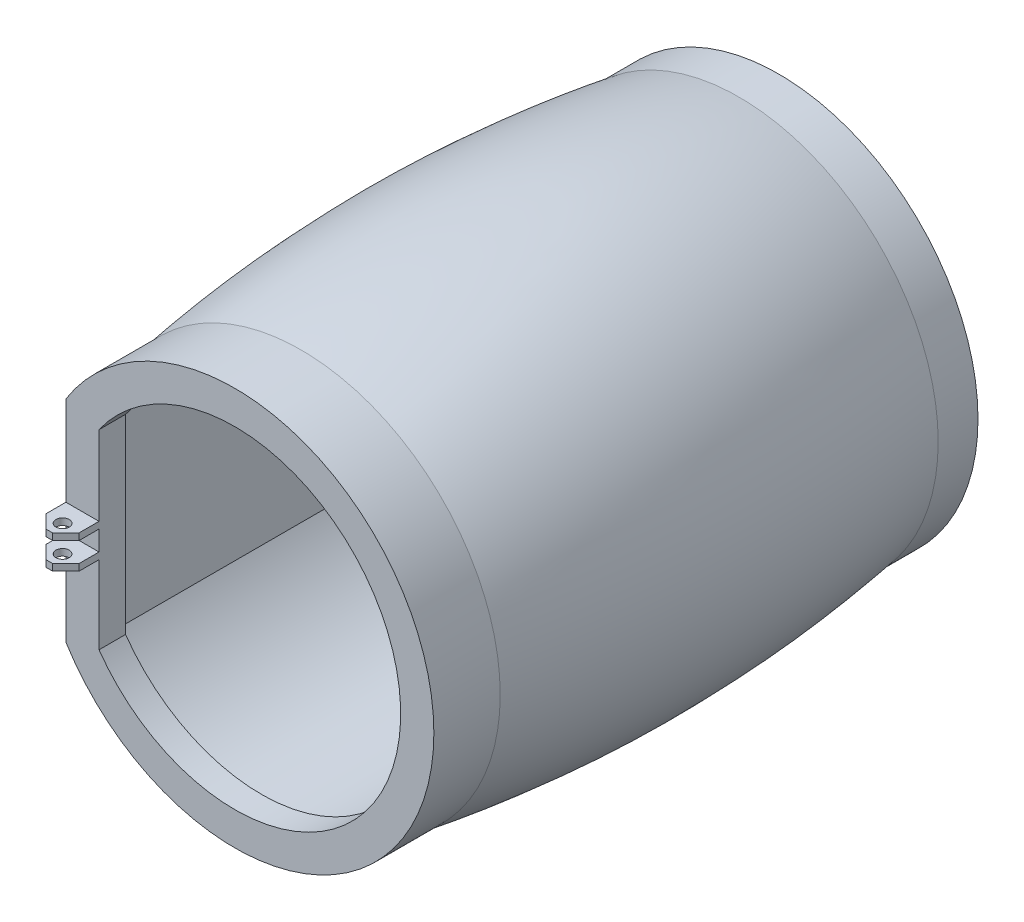
ISO-10303-21;
HEADER;
FILE_DESCRIPTION(('STEP AP214'),'2;1');
FILE_NAME('part.step','',(''),(''),'','','');
FILE_SCHEMA(('AUTOMOTIVE_DESIGN { 1 0 10303 214 1 1 1 1 }'));
ENDSEC;
DATA;
#1=APPLICATION_CONTEXT('core data for automotive mechanical design processes');
#2=APPLICATION_PROTOCOL_DEFINITION('international standard','automotive_design',2000,#1);
#3=PRODUCT_CONTEXT('',#1,'mechanical');
#4=PRODUCT('Part','Part','',(#3));
#5=PRODUCT_RELATED_PRODUCT_CATEGORY('part','',(#4));
#6=PRODUCT_DEFINITION_FORMATION('','',#4);
#7=PRODUCT_DEFINITION_CONTEXT('part definition',#1,'design');
#8=PRODUCT_DEFINITION('design','',#6,#7);
#9=PRODUCT_DEFINITION_SHAPE('','',#8);
#10=(LENGTH_UNIT() NAMED_UNIT(*) SI_UNIT(.MILLI.,.METRE.));
#11=(NAMED_UNIT(*) PLANE_ANGLE_UNIT() SI_UNIT($,.RADIAN.));
#12=(NAMED_UNIT(*) SI_UNIT($,.STERADIAN.) SOLID_ANGLE_UNIT());
#13=UNCERTAINTY_MEASURE_WITH_UNIT(LENGTH_MEASURE(1.E-05),#10,'distance_accuracy_value','');
#14=(GEOMETRIC_REPRESENTATION_CONTEXT(3) GLOBAL_UNCERTAINTY_ASSIGNED_CONTEXT((#13)) GLOBAL_UNIT_ASSIGNED_CONTEXT((#10,
#11,#12)) REPRESENTATION_CONTEXT('',''));
#15=CARTESIAN_POINT('',(0.,0.,0.));
#16=DIRECTION('',(0.,0.,1.));
#17=DIRECTION('',(1.,0.,0.));
#18=AXIS2_PLACEMENT_3D('',#15,#16,#17);
#19=CARTESIAN_POINT('',(-12.7256757763495,1.19854065609115,40.5));
#20=DIRECTION('',(1.,0.,0.));
#21=DIRECTION('',(0.,0.,-1.));
#22=AXIS2_PLACEMENT_3D('',#19,#20,#21);
#23=PLANE('',#22);
#24=DIRECTION('',(0.,0.,-1.));
#25=VECTOR('',#24,1.);
#26=CARTESIAN_POINT('',(-12.7256757763495,-1.30145934390885,40.5));
#27=LINE('',#26,#25);
#28=CARTESIAN_POINT('',(-12.7256757763495,-1.30145934390885,39.5));
#29=VERTEX_POINT('',#28);
#30=CARTESIAN_POINT('',(-12.7281293563886,-1.30145934390884,38.));
#31=VERTEX_POINT('',#30);
#32=EDGE_CURVE('E230',#29,#31,#27,.T.);
#33=ORIENTED_EDGE('',*,*,#32,.F.);
#34=DIRECTION('',(0.,1.,0.));
#35=VECTOR('',#34,1.);
#36=CARTESIAN_POINT('',(-12.7256757763495,-0.801459343908846,39.5));
#37=LINE('',#36,#35);
#38=CARTESIAN_POINT('',(-12.7256757763495,-0.801459343908846,39.5));
#39=VERTEX_POINT('',#38);
#40=EDGE_CURVE('E352',#29,#39,#37,.T.);
#41=ORIENTED_EDGE('',*,*,#40,.T.);
#42=DIRECTION('',(0.,0.,1.));
#43=VECTOR('',#42,1.);
#44=CARTESIAN_POINT('',(-12.7256757763495,-0.801459343908846,38.));
#45=LINE('',#44,#43);
#46=CARTESIAN_POINT('',(-12.7281293563886,-0.801459343908846,38.));
#47=VERTEX_POINT('',#46);
#48=EDGE_CURVE('E211',#47,#39,#45,.T.);
#49=ORIENTED_EDGE('',*,*,#48,.F.);
#50=CARTESIAN_POINT('',(-12.7256757763495,-0.801459343908846,38.));
#51=DIRECTION('',(0.,-1.,0.));
#52=VECTOR('',#51,1.);
#53=LINE('',#50,#52);
#54=EDGE_CURVE('E354',#47,#31,#53,.T.);
#55=ORIENTED_EDGE('',*,*,#54,.T.);
#56=EDGE_LOOP('',(#33,#41,#49,#55));
#57=FACE_BOUND('',#56,.T.);
#58=ADVANCED_FACE('F43',(#57),#23,.F.);
#59=CARTESIAN_POINT('',(0.,0.,40.5));
#60=DIRECTION('',(0.,0.,1.));
#61=DIRECTION('',(1.,0.,0.));
#62=AXIS2_PLACEMENT_3D('',#59,#60,#61);
#63=PLANE('',#62);
#64=DIRECTION('',(1.,0.,0.));
#65=VECTOR('',#64,1.);
#66=CARTESIAN_POINT('',(-12.7256757763495,-0.801459343908846,40.5));
#67=LINE('',#66,#65);
#68=CARTESIAN_POINT('',(-11.7256757763495,-0.801459343908846,40.5));
#69=VERTEX_POINT('',#68);
#70=CARTESIAN_POINT('',(-11.23,-0.801459343908846,40.5));
#71=VERTEX_POINT('',#70);
#72=EDGE_CURVE('E203',#69,#71,#67,.T.);
#73=ORIENTED_EDGE('',*,*,#72,.F.);
#74=DIRECTION('',(0.,-1.,0.));
#75=VECTOR('',#74,1.);
#76=CARTESIAN_POINT('',(-11.7256757763495,-1.30145934390885,40.5));
#77=LINE('',#76,#75);
#78=CARTESIAN_POINT('',(-11.7256757763495,-1.30145934390885,40.5));
#79=VERTEX_POINT('',#78);
#80=EDGE_CURVE('E401',#69,#79,#77,.T.);
#81=ORIENTED_EDGE('',*,*,#80,.T.);
#82=DIRECTION('',(1.,0.,0.));
#83=VECTOR('',#82,1.);
#84=CARTESIAN_POINT('',(-12.7256757763495,-1.30145934390885,40.5));
#85=LINE('',#84,#83);
#86=CARTESIAN_POINT('',(-11.23,-1.30145934390885,40.5));
#87=VERTEX_POINT('',#86);
#88=EDGE_CURVE('E222',#79,#87,#85,.T.);
#89=ORIENTED_EDGE('',*,*,#88,.T.);
#90=DIRECTION('',(0.,1.,0.));
#91=VECTOR('',#90,1.);
#92=CARTESIAN_POINT('',(-11.23,-0.801459343908846,40.5));
#93=LINE('',#92,#91);
#94=EDGE_CURVE('E407',#87,#71,#93,.T.);
#95=ORIENTED_EDGE('',*,*,#94,.T.);
#96=EDGE_LOOP('',(#73,#81,#89,#95));
#97=FACE_BOUND('',#96,.T.);
#98=ADVANCED_FACE('F324',(#97),#63,.T.);
#99=CARTESIAN_POINT('',(-12.7305829364277,-7.93298544677444,33.));
#100=DIRECTION('',(1.,0.,0.));
#101=DIRECTION('',(0.,0.,-1.));
#102=AXIS2_PLACEMENT_3D('',#99,#100,#101);
#103=PLANE('',#102);
#104=DIRECTION('',(0.,0.,-1.));
#105=VECTOR('',#104,1.);
#106=CARTESIAN_POINT('',(-12.7305829364278,-7.93298544677419,36.));
#107=LINE('',#106,#105);
#108=CARTESIAN_POINT('',(-12.7305829364278,-7.93298544677419,38.));
#109=VERTEX_POINT('',#108);
#110=CARTESIAN_POINT('',(-12.7305829364277,-7.93298544677425,33.));
#111=VERTEX_POINT('',#110);
#112=EDGE_CURVE('E533',#109,#111,#107,.T.);
#113=ORIENTED_EDGE('',*,*,#112,.F.);
#114=CARTESIAN_POINT('',(-12.7305829364277,-1.30145934390884,38.));
#115=DIRECTION('',(0.,-1.,0.));
#116=VECTOR('',#115,1.);
#117=LINE('',#114,#116);
#118=EDGE_CURVE('E297',#31,#109,#117,.T.);
#119=ORIENTED_EDGE('',*,*,#118,.F.);
#120=ORIENTED_EDGE('',*,*,#54,.F.);
#121=DIRECTION('',(0.,-1.,0.));
#122=VECTOR('',#121,1.);
#123=CARTESIAN_POINT('',(-12.7305829364277,-7.93298544677444,38.));
#124=LINE('',#123,#122);
#125=CARTESIAN_POINT('',(-12.7281293563886,0.698540656091155,38.));
#126=VERTEX_POINT('',#125);
#127=EDGE_CURVE('E192',#126,#47,#124,.T.);
#128=ORIENTED_EDGE('',*,*,#127,.F.);
#129=CARTESIAN_POINT('',(-12.7256757763495,1.19854065609115,38.));
#130=DIRECTION('',(0.,-1.,0.));
#131=VECTOR('',#130,1.);
#132=LINE('',#129,#131);
#133=CARTESIAN_POINT('',(-12.7281293563886,1.19854065609115,38.));
#134=VERTEX_POINT('',#133);
#135=EDGE_CURVE('E239',#134,#126,#132,.T.);
#136=ORIENTED_EDGE('',*,*,#135,.F.);
#137=CARTESIAN_POINT('',(-12.7305829364277,7.93298544677428,38.));
#138=DIRECTION('',(0.,-1.,0.));
#139=VECTOR('',#138,1.);
#140=LINE('',#137,#139);
#141=CARTESIAN_POINT('',(-12.7305829364277,7.93298544677428,38.));
#142=VERTEX_POINT('',#141);
#143=EDGE_CURVE('E492',#142,#134,#140,.T.);
#144=ORIENTED_EDGE('',*,*,#143,.F.);
#145=DIRECTION('',(0.,0.,-1.));
#146=VECTOR('',#145,1.);
#147=CARTESIAN_POINT('',(-12.7305829364277,7.93298544677428,36.));
#148=LINE('',#147,#146);
#149=CARTESIAN_POINT('',(-12.7305829364277,7.93298544677425,33.));
#150=VERTEX_POINT('',#149);
#151=EDGE_CURVE('E309',#150,#142,#148,.F.);
#152=ORIENTED_EDGE('',*,*,#151,.F.);
#153=CARTESIAN_POINT('',(-12.7305829364277,7.93298544677409,33.0000000000001));
#154=CARTESIAN_POINT('',(-12.7305829364277,8.00837206629518,32.7475623512414));
#155=CARTESIAN_POINT('',(-12.7305829364277,8.08146704888806,32.4944489521295));
#156=CARTESIAN_POINT('',(-12.7305829364277,8.22325568738766,31.9870000357536));
#157=CARTESIAN_POINT('',(-12.7305829364277,8.29194947688966,31.7326645558371));
#158=CARTESIAN_POINT('',(-12.7305829364277,8.49164607614323,30.9682353714513));
#159=CARTESIAN_POINT('',(-12.7305829364277,8.61633456610338,30.4564816236054));
#160=CARTESIAN_POINT('',(-12.7305829364277,8.84996032241162,29.4294701807765));
#161=CARTESIAN_POINT('',(-12.7305829364277,8.95889921338174,28.9142128529483));
#162=CARTESIAN_POINT('',(-12.7305829364277,9.16181168313684,27.88113196776));
#163=CARTESIAN_POINT('',(-12.7305829364277,9.25579547947788,27.3633104138897));
#164=CARTESIAN_POINT('',(-12.7305829364277,9.42953491665978,26.3252307143703));
#165=CARTESIAN_POINT('',(-12.7305829364277,9.50928890448771,25.8049722928358));
#166=CARTESIAN_POINT('',(-12.7305829364277,9.65504479871085,24.7625098329909));
#167=CARTESIAN_POINT('',(-12.7305829364277,9.72104601135835,24.2403056978823));
#168=CARTESIAN_POINT('',(-12.7305829364277,9.83954820880807,23.1953529165281));
#169=CARTESIAN_POINT('',(-12.7305829364277,9.89207402675923,22.6726070805153));
#170=CARTESIAN_POINT('',(-12.7305829364277,9.9840524889991,21.6260022655936));
#171=CARTESIAN_POINT('',(-12.7305829364277,10.0235059669603,21.1021433598146));
#172=CARTESIAN_POINT('',(-12.7305829364277,10.0895340608829,20.0536452982112));
#173=CARTESIAN_POINT('',(-12.7305829364277,10.1161093949715,19.5290061875303));
#174=CARTESIAN_POINT('',(-12.7305829364277,10.15651650427,18.4790228224062));
#175=CARTESIAN_POINT('',(-12.7305829364277,10.1703430462815,17.9536783669627));
#176=CARTESIAN_POINT('',(-12.7305829364277,10.1852970680309,16.902781178733));
#177=CARTESIAN_POINT('',(-12.7305829364277,10.1864238857039,16.3772284365167));
#178=CARTESIAN_POINT('',(-12.7305829364277,10.175980761889,15.326163174232));
#179=CARTESIAN_POINT('',(-12.7305829364277,10.1644087059074,14.8006506754377));
#180=CARTESIAN_POINT('',(-12.7305829364277,10.1258618334699,13.6724680435438));
#181=CARTESIAN_POINT('',(-12.7305829364277,10.0968644940287,13.0698658247955));
#182=CARTESIAN_POINT('',(-12.7305829364277,10.021893388911,11.8656613076854));
#183=CARTESIAN_POINT('',(-12.7305829364277,9.97591802965207,11.2640591085131));
#184=CARTESIAN_POINT('',(-12.7305829364277,9.86669908643272,10.0624553205015));
#185=CARTESIAN_POINT('',(-12.7305829364277,9.80345650781428,9.46245364052904));
#186=CARTESIAN_POINT('',(-12.7305829364277,9.6592784078111,8.26466488162684));
#187=CARTESIAN_POINT('',(-12.7305829364277,9.57834555448058,7.66687748254961));
#188=CARTESIAN_POINT('',(-12.7305829364277,9.39811419547927,6.47367267227986));
#189=CARTESIAN_POINT('',(-12.7305829364277,9.29880368630545,5.87825707140157));
#190=CARTESIAN_POINT('',(-12.7305829364277,9.08101428124022,4.69090718869277));
#191=CARTESIAN_POINT('',(-12.7305829364277,8.96253516421566,4.09897294710562));
#192=CARTESIAN_POINT('',(-12.7305829364277,8.76956609762279,3.2143318729075));
#193=CARTESIAN_POINT('',(-12.7305829364277,8.70268971016925,2.9199491860141));
#194=CARTESIAN_POINT('',(-12.7305829364277,8.5636675930795,2.33243036775551));
#195=CARTESIAN_POINT('',(-12.7305829364277,8.49152192887362,2.03929422095944));
#196=CARTESIAN_POINT('',(-12.7305829364277,8.34169284948403,1.45419259046193));
#197=CARTESIAN_POINT('',(-12.7305829364277,8.26400511538917,1.16222821125265));
#198=CARTESIAN_POINT('',(-12.7305829364277,8.10287586479882,0.579879006120832));
#199=CARTESIAN_POINT('',(-12.7305829364277,8.0194341008544,0.289494248709161));
#200=CARTESIAN_POINT('',(-12.7305829364277,7.93298544677448,0.));
#201=B_SPLINE_CURVE_WITH_KNOTS('',3,(#153,#154,#155,#156,#157,#158,#159,#160,#161,#162,#163,
#164,#165,#166,#167,#168,#169,#170,#171,#172,#173,#174,#175,#176,#177,#178,#179,#180,#181,#182,
#183,#184,#185,#186,#187,#188,#189,#190,#191,#192,#193,#194,#195,#196,#197,#198,#199,#200),
.UNSPECIFIED.,.F.,.F.,(4,2,2,2,2,2,2,2,2,2,2,2,2,2,2,2,2,2,2,2,2,2,2,4),(0.,0.790336265037755,
1.58064852856817,3.16053083364895,4.74025005230529,6.31888530442319,7.89770382027957,
9.47660195909956,11.052569176648,12.6284358694648,14.2042146767263,15.7806400312548,
17.3571475679462,18.9339176492674,20.7435744376166,22.5534011262796,24.3631224646404,
26.1725710482138,27.9832056850179,29.7938612111789,30.6994718223357,31.6050711901399,
32.5113841638653,33.4177361374223),.UNSPECIFIED.);
#202=CARTESIAN_POINT('',(-12.7305829364277,7.93298544677448,0.));
#203=VERTEX_POINT('',#202);
#204=EDGE_CURVE('E415',#150,#203,#201,.T.);
#205=ORIENTED_EDGE('',*,*,#204,.T.);
#206=DIRECTION('',(0.,0.,1.));
#207=VECTOR('',#206,1.);
#208=CARTESIAN_POINT('',(-12.7305829364277,7.93298544677449,-3.));
#209=LINE('',#208,#207);
#210=CARTESIAN_POINT('',(-12.7305829364277,7.93298544677449,-3.));
#211=VERTEX_POINT('',#210);
#212=EDGE_CURVE('E525',#211,#203,#209,.T.);
#213=ORIENTED_EDGE('',*,*,#212,.F.);
#214=DIRECTION('',(0.,-1.,0.));
#215=VECTOR('',#214,1.);
#216=CARTESIAN_POINT('',(-12.7305829364277,10.1844229008457,-3.));
#217=LINE('',#216,#215);
#218=CARTESIAN_POINT('',(-12.7305829364278,-7.93298544677439,-3.));
#219=VERTEX_POINT('',#218);
#220=EDGE_CURVE('E522',#211,#219,#217,.T.);
#221=ORIENTED_EDGE('',*,*,#220,.T.);
#222=DIRECTION('',(0.,0.,1.));
#223=VECTOR('',#222,1.);
#224=CARTESIAN_POINT('',(-12.7305829364278,-7.93298544677439,-3.));
#225=LINE('',#224,#223);
#226=CARTESIAN_POINT('',(-12.7305829364278,-7.93298544677439,0.));
#227=VERTEX_POINT('',#226);
#228=EDGE_CURVE('E529',#227,#219,#225,.F.);
#229=ORIENTED_EDGE('',*,*,#228,.F.);
#230=CARTESIAN_POINT('',(-12.7305829364278,-7.9329854467744,0.));
#231=CARTESIAN_POINT('',(-12.7305829364278,-8.00837206629549,0.252437648758758));
#232=CARTESIAN_POINT('',(-12.7305829364278,-8.08146704888837,0.505551047870649));
#233=CARTESIAN_POINT('',(-12.7305829364278,-8.22325568738795,1.01299996424665));
#234=CARTESIAN_POINT('',(-12.7305829364278,-8.29194947688993,1.26733544416315));
#235=CARTESIAN_POINT('',(-12.7305829364278,-8.4916460761435,2.03176462854896));
#236=CARTESIAN_POINT('',(-12.7305829364278,-8.61633456610368,2.54351837639488));
#237=CARTESIAN_POINT('',(-12.7305829364278,-8.84996032241191,3.57052981922388));
#238=CARTESIAN_POINT('',(-12.7305829364278,-8.95889921338199,4.08578714705205));
#239=CARTESIAN_POINT('',(-12.7305829364278,-9.16181168313706,5.11886803224043));
#240=CARTESIAN_POINT('',(-12.7305829364278,-9.25579547947813,5.63668958611073));
#241=CARTESIAN_POINT('',(-12.7305829364278,-9.42953491665998,6.67476928563026));
#242=CARTESIAN_POINT('',(-12.7305829364278,-9.50928890448784,7.19502770716477));
#243=CARTESIAN_POINT('',(-12.7305829364278,-9.65504479871094,8.23749016700975));
#244=CARTESIAN_POINT('',(-12.7305829364278,-9.72104601135848,8.75969430211834));
#245=CARTESIAN_POINT('',(-12.7305829364278,-9.83954820880819,9.80464708347265));
#246=CARTESIAN_POINT('',(-12.7305829364278,-9.89207402675932,10.3273929194855));
#247=CARTESIAN_POINT('',(-12.7305829364278,-9.98405248899915,11.3739977344072));
#248=CARTESIAN_POINT('',(-12.7305829364278,-10.0235059669603,11.8978566401862));
#249=CARTESIAN_POINT('',(-12.7305829364278,-10.0895340608829,12.9463547017897));
#250=CARTESIAN_POINT('',(-12.7305829364278,-10.1161093949715,13.4709938124706));
#251=CARTESIAN_POINT('',(-12.7305829364278,-10.15651650427,14.5209771775947));
#252=CARTESIAN_POINT('',(-12.7305829364278,-10.1703430462815,15.0463216330383));
#253=CARTESIAN_POINT('',(-12.7305829364278,-10.1852970680308,16.0972188212681));
#254=CARTESIAN_POINT('',(-12.7305829364278,-10.1864238857038,16.6227715634844));
#255=CARTESIAN_POINT('',(-12.7305829364278,-10.1759807618889,17.6738368257691));
#256=CARTESIAN_POINT('',(-12.7305829364278,-10.1644087059073,18.1993493245635));
#257=CARTESIAN_POINT('',(-12.7305829364278,-10.1258618334697,19.3275319564573));
#258=CARTESIAN_POINT('',(-12.7305829364278,-10.0968644940285,19.9301341752055));
#259=CARTESIAN_POINT('',(-12.7305829364278,-10.0218933889108,21.1343386923156));
#260=CARTESIAN_POINT('',(-12.7305829364278,-9.97591802965182,21.7359408914879));
#261=CARTESIAN_POINT('',(-12.7305829364278,-9.86669908643245,22.9375446794994));
#262=CARTESIAN_POINT('',(-12.7305829364278,-9.80345650781401,23.5375463594718));
#263=CARTESIAN_POINT('',(-12.7305829364278,-9.65927840781077,24.7353351183739));
#264=CARTESIAN_POINT('',(-12.7305829364278,-9.5783455544802,25.3331225174511));
#265=CARTESIAN_POINT('',(-12.7305829364278,-9.39811419547883,26.5263273277208));
#266=CARTESIAN_POINT('',(-12.7305829364278,-9.29880368630501,27.121742928599));
#267=CARTESIAN_POINT('',(-12.7305829364278,-9.08101428123978,28.3090928113077));
#268=CARTESIAN_POINT('',(-12.7305829364278,-8.96253516421522,28.9010270528949));
#269=CARTESIAN_POINT('',(-12.7305829364278,-8.7695660976223,29.7856681270929));
#270=CARTESIAN_POINT('',(-12.7305829364278,-8.70268971016873,30.0800508139863));
#271=CARTESIAN_POINT('',(-12.7305829364278,-8.56366759307897,30.6675696322448));
#272=CARTESIAN_POINT('',(-12.7305829364278,-8.49152192887312,30.9607057790409));
#273=CARTESIAN_POINT('',(-12.7305829364278,-8.34169284948354,31.5458074095384));
#274=CARTESIAN_POINT('',(-12.7305829364278,-8.26400511538866,31.8377717887476));
#275=CARTESIAN_POINT('',(-12.7305829364278,-8.10287586479829,32.4201209938794));
#276=CARTESIAN_POINT('',(-12.7305829364278,-8.01943410085388,32.710505751291));
#277=CARTESIAN_POINT('',(-12.7305829364277,-7.932985446774,33.0000000000001));
#278=B_SPLINE_CURVE_WITH_KNOTS('',3,(#230,#231,#232,#233,#234,#235,#236,#237,#238,#239,#240,
#241,#242,#243,#244,#245,#246,#247,#248,#249,#250,#251,#252,#253,#254,#255,#256,#257,#258,#259,
#260,#261,#262,#263,#264,#265,#266,#267,#268,#269,#270,#271,#272,#273,#274,#275,#276,#277),
.UNSPECIFIED.,.F.,.F.,(4,2,2,2,2,2,2,2,2,2,2,2,2,2,2,2,2,2,2,2,2,2,2,4),(0.,0.790336265037792,
1.58064852856824,3.1605308336491,4.74025005230552,6.31888530442351,7.89770382027996,
9.47660195910003,11.0525691766486,12.6284358694654,14.204214676727,15.7806400312556,
17.3571475679471,18.9339176492683,20.7435744376174,22.5534011262803,24.363122464641,
26.1725710482143,27.9832056850183,29.7938612111792,30.6994718223359,31.60507119014,
32.5113841638654,33.4177361374223),.UNSPECIFIED.);
#279=EDGE_CURVE('E411',#227,#111,#278,.T.);
#280=ORIENTED_EDGE('',*,*,#279,.T.);
#281=EDGE_LOOP('',(#113,#119,#120,#128,#136,#144,#152,#205,#213,#221,#229,#280));
#282=FACE_BOUND('',#281,.T.);
#283=ADVANCED_FACE('F313',(#282),#103,.F.);
#284=CARTESIAN_POINT('',(0.,0.,0.));
#285=DIRECTION('',(0.,0.,1.));
#286=DIRECTION('',(1.,0.,0.));
#287=AXIS2_PLACEMENT_3D('',#284,#285,#286);
#288=CYLINDRICAL_SURFACE('',#287,13.5);
#289=CARTESIAN_POINT('',(0.,0.,36.));
#290=DIRECTION('',(0.,0.,1.));
#291=DIRECTION('',(1.,0.,0.));
#292=AXIS2_PLACEMENT_3D('',#289,#290,#291);
#293=CIRCLE('',#292,13.5);
#294=CARTESIAN_POINT('',(-11.23,-7.49246955282435,36.));
#295=VERTEX_POINT('',#294);
#296=CARTESIAN_POINT('',(-11.23,7.49246955282435,36.));
#297=VERTEX_POINT('',#296);
#298=EDGE_CURVE('E542',#295,#297,#293,.T.);
#299=ORIENTED_EDGE('',*,*,#298,.T.);
#300=DIRECTION('',(0.,0.,1.));
#301=VECTOR('',#300,1.);
#302=CARTESIAN_POINT('',(-11.23,7.49246955282435,0.));
#303=LINE('',#302,#301);
#304=CARTESIAN_POINT('',(-11.23,7.49246955282435,-3.));
#305=VERTEX_POINT('',#304);
#306=EDGE_CURVE('E545',#305,#297,#303,.T.);
#307=ORIENTED_EDGE('',*,*,#306,.F.);
#308=CARTESIAN_POINT('',(0.,0.,-3.));
#309=DIRECTION('',(0.,0.,-1.));
#310=DIRECTION('',(-1.,0.,0.));
#311=AXIS2_PLACEMENT_3D('',#308,#309,#310);
#312=CIRCLE('',#311,13.5);
#313=CARTESIAN_POINT('',(-11.23,-7.49246955282435,-3.));
#314=VERTEX_POINT('',#313);
#315=EDGE_CURVE('E534',#305,#314,#312,.T.);
#316=ORIENTED_EDGE('',*,*,#315,.T.);
#317=DIRECTION('',(0.,0.,1.));
#318=VECTOR('',#317,1.);
#319=CARTESIAN_POINT('',(-11.23,-7.49246955282435,0.));
#320=LINE('',#319,#318);
#321=EDGE_CURVE('E550',#314,#295,#320,.T.);
#322=ORIENTED_EDGE('',*,*,#321,.T.);
#323=EDGE_LOOP('',(#299,#307,#316,#322));
#324=FACE_BOUND('',#323,.T.);
#325=ADVANCED_FACE('F323',(#324),#288,.F.);
#326=CARTESIAN_POINT('',(-11.23,7.49246955282435,0.));
#327=DIRECTION('',(-1.,0.,0.));
#328=DIRECTION('',(0.,0.,1.));
#329=AXIS2_PLACEMENT_3D('',#326,#327,#328);
#330=PLANE('',#329);
#331=ORIENTED_EDGE('',*,*,#306,.T.);
#332=DIRECTION('',(0.,1.,0.));
#333=VECTOR('',#332,1.);
#334=CARTESIAN_POINT('',(-11.23,7.49246955282435,36.));
#335=LINE('',#334,#333);
#336=EDGE_CURVE('E500',#295,#297,#335,.T.);
#337=ORIENTED_EDGE('',*,*,#336,.F.);
#338=ORIENTED_EDGE('',*,*,#321,.F.);
#339=DIRECTION('',(0.,1.,0.));
#340=VECTOR('',#339,1.);
#341=CARTESIAN_POINT('',(-11.23,7.49246955282435,-3.));
#342=LINE('',#341,#340);
#343=EDGE_CURVE('E518',#314,#305,#342,.T.);
#344=ORIENTED_EDGE('',*,*,#343,.T.);
#345=EDGE_LOOP('',(#331,#337,#338,#344));
#346=FACE_BOUND('',#345,.T.);
#347=ADVANCED_FACE('F561',(#346),#330,.F.);
#348=CARTESIAN_POINT('',(15.,0.,33.));
#349=CARTESIAN_POINT('',(17.6061473789552,0.,16.5));
#350=CARTESIAN_POINT('',(15.,0.,0.));
#351=B_SPLINE_CURVE_WITH_KNOTS('',2,(#348,#349,#350),.UNSPECIFIED.,.F.,.F.,(3,3),(0.,1.),.UNSPECIFIED.);
#352=CARTESIAN_POINT('',(3.49148133884313E-12,0.,1000.));
#353=DIRECTION('',(0.,0.,1.));
#354=AXIS1_PLACEMENT('',#352,#353);
#355=SURFACE_OF_REVOLUTION('',#351,#354);
#356=ORIENTED_EDGE('',*,*,#279,.F.);
#357=CARTESIAN_POINT('',(0.,0.,0.));
#358=DIRECTION('',(0.,0.,1.));
#359=DIRECTION('',(1.,0.,0.));
#360=AXIS2_PLACEMENT_3D('',#357,#358,#359);
#361=CIRCLE('',#360,15.);
#362=EDGE_CURVE('E578',#227,#203,#361,.T.);
#363=ORIENTED_EDGE('',*,*,#362,.T.);
#364=ORIENTED_EDGE('',*,*,#204,.F.);
#365=CARTESIAN_POINT('',(0.,0.,33.));
#366=DIRECTION('',(0.,0.,1.));
#367=DIRECTION('',(1.,0.,0.));
#368=AXIS2_PLACEMENT_3D('',#365,#366,#367);
#369=CIRCLE('',#368,15.);
#370=EDGE_CURVE('E577',#111,#150,#369,.T.);
#371=ORIENTED_EDGE('',*,*,#370,.F.);
#372=EDGE_LOOP('',(#356,#363,#364,#371));
#373=FACE_BOUND('',#372,.T.);
#374=ADVANCED_FACE('F556',(#373),#355,.F.);
#375=CARTESIAN_POINT('',(0.,0.,36.));
#376=DIRECTION('',(0.,0.,-1.));
#377=DIRECTION('',(-1.,0.,0.));
#378=AXIS2_PLACEMENT_3D('',#375,#376,#377);
#379=CYLINDRICAL_SURFACE('',#378,14.9999999999999);
#380=ORIENTED_EDGE('',*,*,#151,.T.);
#381=CARTESIAN_POINT('',(0.,0.,38.));
#382=DIRECTION('',(0.,0.,1.));
#383=DIRECTION('',(1.,0.,0.));
#384=AXIS2_PLACEMENT_3D('',#381,#382,#383);
#385=CIRCLE('',#384,14.9999999999999);
#386=EDGE_CURVE('E496',#109,#142,#385,.T.);
#387=ORIENTED_EDGE('',*,*,#386,.F.);
#388=ORIENTED_EDGE('',*,*,#112,.T.);
#389=ORIENTED_EDGE('',*,*,#370,.T.);
#390=EDGE_LOOP('',(#380,#387,#388,#389));
#391=FACE_BOUND('',#390,.T.);
#392=ADVANCED_FACE('F560',(#391),#379,.T.);
#393=CARTESIAN_POINT('',(0.,0.,-3.));
#394=DIRECTION('',(0.,0.,-1.));
#395=DIRECTION('',(-1.,0.,0.));
#396=AXIS2_PLACEMENT_3D('',#393,#394,#395);
#397=PLANE('',#396);
#398=ORIENTED_EDGE('',*,*,#220,.F.);
#399=CARTESIAN_POINT('',(0.,0.,-3.));
#400=DIRECTION('',(0.,0.,-1.));
#401=DIRECTION('',(-1.,0.,0.));
#402=AXIS2_PLACEMENT_3D('',#399,#400,#401);
#403=CIRCLE('',#402,15.);
#404=EDGE_CURVE('E538',#211,#219,#403,.T.);
#405=ORIENTED_EDGE('',*,*,#404,.T.);
#406=EDGE_LOOP('',(#398,#405));
#407=FACE_BOUND('',#406,.T.);
#408=ORIENTED_EDGE('',*,*,#315,.F.);
#409=ORIENTED_EDGE('',*,*,#343,.F.);
#410=EDGE_LOOP('',(#408,#409));
#411=FACE_BOUND('',#410,.T.);
#412=ADVANCED_FACE('F599',(#407,#411),#397,.T.);
#413=CARTESIAN_POINT('',(0.,0.,-3.));
#414=DIRECTION('',(0.,0.,1.));
#415=DIRECTION('',(1.,0.,0.));
#416=AXIS2_PLACEMENT_3D('',#413,#414,#415);
#417=CYLINDRICAL_SURFACE('',#416,15.);
#418=ORIENTED_EDGE('',*,*,#404,.F.);
#419=ORIENTED_EDGE('',*,*,#212,.T.);
#420=ORIENTED_EDGE('',*,*,#362,.F.);
#421=ORIENTED_EDGE('',*,*,#228,.T.);
#422=EDGE_LOOP('',(#418,#419,#420,#421));
#423=FACE_BOUND('',#422,.T.);
#424=ADVANCED_FACE('F595',(#423),#417,.T.);
#425=CARTESIAN_POINT('',(0.,0.,36.));
#426=DIRECTION('',(0.,0.,1.));
#427=DIRECTION('',(1.,0.,0.));
#428=AXIS2_PLACEMENT_3D('',#425,#426,#427);
#429=PLANE('',#428);
#430=DIRECTION('',(0.,-1.,0.));
#431=VECTOR('',#430,1.);
#432=CARTESIAN_POINT('',(-10.23,0.,36.));
#433=LINE('',#432,#431);
#434=CARTESIAN_POINT('',(-10.23,7.18311213889913,36.));
#435=VERTEX_POINT('',#434);
#436=CARTESIAN_POINT('',(-10.23,-7.18311213889913,36.));
#437=VERTEX_POINT('',#436);
#438=EDGE_CURVE('E505',#435,#437,#433,.T.);
#439=ORIENTED_EDGE('',*,*,#438,.T.);
#440=CARTESIAN_POINT('',(0.,0.,36.));
#441=DIRECTION('',(0.,0.,1.));
#442=DIRECTION('',(1.,0.,0.));
#443=AXIS2_PLACEMENT_3D('',#440,#441,#442);
#444=CIRCLE('',#443,12.5);
#445=EDGE_CURVE('E502',#437,#435,#444,.T.);
#446=ORIENTED_EDGE('',*,*,#445,.T.);
#447=EDGE_LOOP('',(#439,#446));
#448=FACE_BOUND('',#447,.T.);
#449=ORIENTED_EDGE('',*,*,#298,.F.);
#450=ORIENTED_EDGE('',*,*,#336,.T.);
#451=EDGE_LOOP('',(#449,#450));
#452=FACE_BOUND('',#451,.T.);
#453=ADVANCED_FACE('F273',(#448,#452),#429,.F.);
#454=CARTESIAN_POINT('',(0.,0.,38.));
#455=DIRECTION('',(0.,0.,1.));
#456=DIRECTION('',(1.,0.,0.));
#457=AXIS2_PLACEMENT_3D('',#454,#455,#456);
#458=PLANE('',#457);
#459=DIRECTION('',(1.,0.,0.));
#460=VECTOR('',#459,1.);
#461=CARTESIAN_POINT('',(-12.7256757763495,-1.30145934390885,38.));
#462=LINE('',#461,#460);
#463=CARTESIAN_POINT('',(-10.23,-1.30145934390885,38.));
#464=VERTEX_POINT('',#463);
#465=EDGE_CURVE('E223',#31,#464,#462,.T.);
#466=ORIENTED_EDGE('',*,*,#465,.F.);
#467=ORIENTED_EDGE('',*,*,#118,.T.);
#468=ORIENTED_EDGE('',*,*,#386,.T.);
#469=ORIENTED_EDGE('',*,*,#143,.T.);
#470=DIRECTION('',(-1.,0.,0.));
#471=VECTOR('',#470,1.);
#472=CARTESIAN_POINT('',(-12.7256757763495,1.19854065609115,38.));
#473=LINE('',#472,#471);
#474=CARTESIAN_POINT('',(-10.23,1.19854065609116,38.));
#475=VERTEX_POINT('',#474);
#476=EDGE_CURVE('E244',#475,#134,#473,.T.);
#477=ORIENTED_EDGE('',*,*,#476,.F.);
#478=DIRECTION('',(0.,-1.,0.));
#479=VECTOR('',#478,1.);
#480=CARTESIAN_POINT('',(-10.23,7.18311213889913,38.));
#481=LINE('',#480,#479);
#482=CARTESIAN_POINT('',(-10.23,7.18311213889913,38.));
#483=VERTEX_POINT('',#482);
#484=EDGE_CURVE('E608',#483,#475,#481,.T.);
#485=ORIENTED_EDGE('',*,*,#484,.F.);
#486=CARTESIAN_POINT('',(0.,0.,38.));
#487=DIRECTION('',(0.,0.,1.));
#488=DIRECTION('',(1.,0.,0.));
#489=AXIS2_PLACEMENT_3D('',#486,#487,#488);
#490=CIRCLE('',#489,12.5);
#491=CARTESIAN_POINT('',(-10.23,-7.18311213889913,38.));
#492=VERTEX_POINT('',#491);
#493=EDGE_CURVE('E234',#492,#483,#490,.T.);
#494=ORIENTED_EDGE('',*,*,#493,.F.);
#495=EDGE_CURVE('E612',#464,#492,#481,.T.);
#496=ORIENTED_EDGE('',*,*,#495,.F.);
#497=EDGE_LOOP('',(#466,#467,#468,#469,#477,#485,#494,#496));
#498=FACE_BOUND('',#497,.T.);
#499=ADVANCED_FACE('F268',(#498),#458,.T.);
#500=CARTESIAN_POINT('',(0.,0.,32.));
#501=DIRECTION('',(0.,0.,1.));
#502=DIRECTION('',(1.,0.,0.));
#503=AXIS2_PLACEMENT_3D('',#500,#501,#502);
#504=CYLINDRICAL_SURFACE('',#503,12.5);
#505=DIRECTION('',(0.,0.,1.));
#506=VECTOR('',#505,1.);
#507=CARTESIAN_POINT('',(-10.23,-7.18311213889913,32.));
#508=LINE('',#507,#506);
#509=EDGE_CURVE('E511',#437,#492,#508,.T.);
#510=ORIENTED_EDGE('',*,*,#509,.T.);
#511=ORIENTED_EDGE('',*,*,#493,.T.);
#512=DIRECTION('',(0.,0.,1.));
#513=VECTOR('',#512,1.);
#514=CARTESIAN_POINT('',(-10.23,7.18311213889913,32.));
#515=LINE('',#514,#513);
#516=EDGE_CURVE('E604',#435,#483,#515,.T.);
#517=ORIENTED_EDGE('',*,*,#516,.F.);
#518=ORIENTED_EDGE('',*,*,#445,.F.);
#519=EDGE_LOOP('',(#510,#511,#517,#518));
#520=FACE_BOUND('',#519,.T.);
#521=ADVANCED_FACE('F265',(#520),#504,.F.);
#522=CARTESIAN_POINT('',(-10.23,7.18311213889913,32.));
#523=DIRECTION('',(-1.,0.,0.));
#524=DIRECTION('',(0.,0.,1.));
#525=AXIS2_PLACEMENT_3D('',#522,#523,#524);
#526=PLANE('',#525);
#527=DIRECTION('',(0.,0.,1.));
#528=VECTOR('',#527,1.);
#529=CARTESIAN_POINT('',(-10.23,-0.801459343908846,38.));
#530=LINE('',#529,#528);
#531=CARTESIAN_POINT('',(-10.23,-0.801459343908846,38.));
#532=VERTEX_POINT('',#531);
#533=CARTESIAN_POINT('',(-10.23,-0.801459343908846,39.5));
#534=VERTEX_POINT('',#533);
#535=EDGE_CURVE('E216',#532,#534,#530,.T.);
#536=ORIENTED_EDGE('',*,*,#535,.T.);
#537=DIRECTION('',(0.,-1.,0.));
#538=VECTOR('',#537,1.);
#539=CARTESIAN_POINT('',(-10.23,-1.30145934390885,39.5));
#540=LINE('',#539,#538);
#541=CARTESIAN_POINT('',(-10.23,-1.30145934390885,39.5));
#542=VERTEX_POINT('',#541);
#543=EDGE_CURVE('E11',#534,#542,#540,.T.);
#544=ORIENTED_EDGE('',*,*,#543,.T.);
#545=DIRECTION('',(0.,0.,-1.));
#546=VECTOR('',#545,1.);
#547=CARTESIAN_POINT('',(-10.23,-1.30145934390885,40.5));
#548=LINE('',#547,#546);
#549=EDGE_CURVE('E227',#542,#464,#548,.T.);
#550=ORIENTED_EDGE('',*,*,#549,.T.);
#551=ORIENTED_EDGE('',*,*,#495,.T.);
#552=ORIENTED_EDGE('',*,*,#509,.F.);
#553=ORIENTED_EDGE('',*,*,#438,.F.);
#554=ORIENTED_EDGE('',*,*,#516,.T.);
#555=ORIENTED_EDGE('',*,*,#484,.T.);
#556=DIRECTION('',(0.,0.,-1.));
#557=VECTOR('',#556,1.);
#558=CARTESIAN_POINT('',(-10.23,1.19854065609115,40.5));
#559=LINE('',#558,#557);
#560=CARTESIAN_POINT('',(-10.23,1.19854065609115,39.5));
#561=VERTEX_POINT('',#560);
#562=EDGE_CURVE('E231',#561,#475,#559,.T.);
#563=ORIENTED_EDGE('',*,*,#562,.F.);
#564=DIRECTION('',(0.,-1.,0.));
#565=VECTOR('',#564,1.);
#566=CARTESIAN_POINT('',(-10.23,0.698540656091155,39.5));
#567=LINE('',#566,#565);
#568=CARTESIAN_POINT('',(-10.23,0.698540656091155,39.5));
#569=VERTEX_POINT('',#568);
#570=EDGE_CURVE('E52',#561,#569,#567,.T.);
#571=ORIENTED_EDGE('',*,*,#570,.T.);
#572=DIRECTION('',(0.,0.,1.));
#573=VECTOR('',#572,1.);
#574=CARTESIAN_POINT('',(-10.23,0.698540656091155,38.));
#575=LINE('',#574,#573);
#576=CARTESIAN_POINT('',(-10.23,0.698540656091155,38.));
#577=VERTEX_POINT('',#576);
#578=EDGE_CURVE('E186',#577,#569,#575,.T.);
#579=ORIENTED_EDGE('',*,*,#578,.F.);
#580=DIRECTION('',(0.,1.,0.));
#581=VECTOR('',#580,1.);
#582=CARTESIAN_POINT('',(-10.23,0.698540656091155,38.));
#583=LINE('',#582,#581);
#584=EDGE_CURVE('E193',#532,#577,#583,.T.);
#585=ORIENTED_EDGE('',*,*,#584,.F.);
#586=EDGE_LOOP('',(#536,#544,#550,#551,#552,#553,#554,#555,#563,#571,#579,#585));
#587=FACE_BOUND('',#586,.T.);
#588=ADVANCED_FACE('F205',(#587),#526,.F.);
#589=CARTESIAN_POINT('',(-12.7256757763495,1.19854065609115,40.5));
#590=DIRECTION('',(0.,-1.,0.));
#591=DIRECTION('',(0.,0.,-1.));
#592=AXIS2_PLACEMENT_3D('',#589,#590,#591);
#593=PLANE('',#592);
#594=CARTESIAN_POINT('',(-11.4778378881748,1.19854065609115,39.5));
#595=DIRECTION('',(0.,-1.,0.));
#596=DIRECTION('',(0.,0.,-1.));
#597=AXIS2_PLACEMENT_3D('',#594,#595,#596);
#598=CIRCLE('',#597,0.500000000000001);
#599=CARTESIAN_POINT('',(-11.4778378881748,1.19854065609115,39.));
#600=VERTEX_POINT('',#599);
#601=EDGE_CURVE('E422',#600,#600,#598,.T.);
#602=ORIENTED_EDGE('',*,*,#601,.T.);
#603=EDGE_LOOP('',(#602));
#604=FACE_BOUND('',#603,.T.);
#605=DIRECTION('',(0.,0.,-1.));
#606=VECTOR('',#605,1.);
#607=CARTESIAN_POINT('',(-12.7256757763495,1.19854065609115,40.5));
#608=LINE('',#607,#606);
#609=CARTESIAN_POINT('',(-12.7256757763495,1.19854065609115,39.5));
#610=VERTEX_POINT('',#609);
#611=EDGE_CURVE('E235',#610,#134,#608,.T.);
#612=ORIENTED_EDGE('',*,*,#611,.F.);
#613=DIRECTION('',(0.707106781186545,0.,0.70710678118655));
#614=VECTOR('',#613,1.);
#615=CARTESIAN_POINT('',(-11.7256757763495,1.19854065609115,40.5));
#616=LINE('',#615,#614);
#617=CARTESIAN_POINT('',(-11.7256757763495,1.19854065609115,40.5));
#618=VERTEX_POINT('',#617);
#619=EDGE_CURVE('E486',#610,#618,#616,.T.);
#620=ORIENTED_EDGE('',*,*,#619,.T.);
#621=DIRECTION('',(-1.,0.,0.));
#622=VECTOR('',#621,1.);
#623=CARTESIAN_POINT('',(-12.7256757763495,1.19854065609115,40.5));
#624=LINE('',#623,#622);
#625=CARTESIAN_POINT('',(-11.23,1.19854065609115,40.5));
#626=VERTEX_POINT('',#625);
#627=EDGE_CURVE('E218',#626,#618,#624,.T.);
#628=ORIENTED_EDGE('',*,*,#627,.F.);
#629=DIRECTION('',(0.707106781186545,0.,-0.70710678118655));
#630=VECTOR('',#629,1.);
#631=CARTESIAN_POINT('',(-11.23,1.19854065609115,40.5));
#632=LINE('',#631,#630);
#633=EDGE_CURVE('E59',#626,#561,#632,.T.);
#634=ORIENTED_EDGE('',*,*,#633,.T.);
#635=ORIENTED_EDGE('',*,*,#562,.T.);
#636=ORIENTED_EDGE('',*,*,#476,.T.);
#637=EDGE_LOOP('',(#612,#620,#628,#634,#635,#636));
#638=FACE_BOUND('',#637,.T.);
#639=ADVANCED_FACE('F258',(#604,#638),#593,.F.);
#640=DIRECTION('',(0.,0.,1.));
#641=VECTOR('',#640,1.);
#642=CARTESIAN_POINT('',(-12.7256757763495,0.698540656091155,38.));
#643=LINE('',#642,#641);
#644=CARTESIAN_POINT('',(-12.7256757763495,0.698540656091155,39.5));
#645=VERTEX_POINT('',#644);
#646=EDGE_CURVE('E188',#126,#645,#643,.T.);
#647=ORIENTED_EDGE('',*,*,#646,.T.);
#648=DIRECTION('',(0.,1.,0.));
#649=VECTOR('',#648,1.);
#650=CARTESIAN_POINT('',(-12.7256757763495,1.19854065609115,39.5));
#651=LINE('',#650,#649);
#652=EDGE_CURVE('E67',#645,#610,#651,.T.);
#653=ORIENTED_EDGE('',*,*,#652,.T.);
#654=ORIENTED_EDGE('',*,*,#611,.T.);
#655=ORIENTED_EDGE('',*,*,#135,.T.);
#656=EDGE_LOOP('',(#647,#653,#654,#655));
#657=FACE_BOUND('',#656,.T.);
#658=ADVANCED_FACE('F247',(#657),#23,.F.);
#659=CARTESIAN_POINT('',(-12.7256757763495,-1.30145934390885,40.5));
#660=DIRECTION('',(0.,1.,0.));
#661=DIRECTION('',(0.,0.,1.));
#662=AXIS2_PLACEMENT_3D('',#659,#660,#661);
#663=PLANE('',#662);
#664=CARTESIAN_POINT('',(-11.4778378881748,-1.30145934390885,39.5));
#665=DIRECTION('',(0.,-1.,0.));
#666=DIRECTION('',(0.,0.,-1.));
#667=AXIS2_PLACEMENT_3D('',#664,#665,#666);
#668=CIRCLE('',#667,0.500000000000001);
#669=CARTESIAN_POINT('',(-11.4778378881748,-1.30145934390885,39.));
#670=VERTEX_POINT('',#669);
#671=EDGE_CURVE('E453',#670,#670,#668,.T.);
#672=ORIENTED_EDGE('',*,*,#671,.F.);
#673=EDGE_LOOP('',(#672));
#674=FACE_BOUND('',#673,.T.);
#675=ORIENTED_EDGE('',*,*,#88,.F.);
#676=DIRECTION('',(-0.707106781186545,0.,-0.70710678118655));
#677=VECTOR('',#676,1.);
#678=CARTESIAN_POINT('',(-11.7256757763495,-1.30145934390885,40.5));
#679=LINE('',#678,#677);
#680=EDGE_CURVE('E361',#79,#29,#679,.T.);
#681=ORIENTED_EDGE('',*,*,#680,.T.);
#682=ORIENTED_EDGE('',*,*,#32,.T.);
#683=ORIENTED_EDGE('',*,*,#465,.T.);
#684=ORIENTED_EDGE('',*,*,#549,.F.);
#685=DIRECTION('',(-0.707106781186545,0.,0.70710678118655));
#686=VECTOR('',#685,1.);
#687=CARTESIAN_POINT('',(-11.23,-1.30145934390885,40.5));
#688=LINE('',#687,#686);
#689=EDGE_CURVE('E370',#542,#87,#688,.T.);
#690=ORIENTED_EDGE('',*,*,#689,.T.);
#691=EDGE_LOOP('',(#675,#681,#682,#683,#684,#690));
#692=FACE_BOUND('',#691,.T.);
#693=ADVANCED_FACE('F257',(#674,#692),#663,.F.);
#694=ORIENTED_EDGE('',*,*,#627,.T.);
#695=DIRECTION('',(0.,-1.,0.));
#696=VECTOR('',#695,1.);
#697=CARTESIAN_POINT('',(-11.7256757763495,0.698540656091155,40.5));
#698=LINE('',#697,#696);
#699=CARTESIAN_POINT('',(-11.7256757763495,0.698540656091155,40.5));
#700=VERTEX_POINT('',#699);
#701=EDGE_CURVE('E380',#618,#700,#698,.T.);
#702=ORIENTED_EDGE('',*,*,#701,.T.);
#703=DIRECTION('',(-1.,0.,0.));
#704=VECTOR('',#703,1.);
#705=CARTESIAN_POINT('',(-12.7256757763495,0.698540656091155,40.5));
#706=LINE('',#705,#704);
#707=CARTESIAN_POINT('',(-11.23,0.698540656091155,40.5));
#708=VERTEX_POINT('',#707);
#709=EDGE_CURVE('E446',#708,#700,#706,.T.);
#710=ORIENTED_EDGE('',*,*,#709,.F.);
#711=DIRECTION('',(0.,1.,0.));
#712=VECTOR('',#711,1.);
#713=CARTESIAN_POINT('',(-11.23,1.19854065609115,40.5));
#714=LINE('',#713,#712);
#715=EDGE_CURVE('E376',#708,#626,#714,.T.);
#716=ORIENTED_EDGE('',*,*,#715,.T.);
#717=EDGE_LOOP('',(#694,#702,#710,#716));
#718=FACE_BOUND('',#717,.T.);
#719=ADVANCED_FACE('F348',(#718),#63,.T.);
#720=CARTESIAN_POINT('',(-12.7256757763495,-0.801459343908846,38.));
#721=DIRECTION('',(0.,-1.,0.));
#722=DIRECTION('',(0.,0.,-1.));
#723=AXIS2_PLACEMENT_3D('',#720,#721,#722);
#724=PLANE('',#723);
#725=CARTESIAN_POINT('',(-11.4778378881748,-0.801459343908846,39.5));
#726=DIRECTION('',(0.,-1.,0.));
#727=DIRECTION('',(0.,0.,-1.));
#728=AXIS2_PLACEMENT_3D('',#725,#726,#727);
#729=CIRCLE('',#728,0.500000000000001);
#730=CARTESIAN_POINT('',(-11.4778378881748,-0.801459343908846,39.));
#731=VERTEX_POINT('',#730);
#732=EDGE_CURVE('E421',#731,#731,#729,.T.);
#733=ORIENTED_EDGE('',*,*,#732,.T.);
#734=EDGE_LOOP('',(#733));
#735=FACE_BOUND('',#734,.T.);
#736=ORIENTED_EDGE('',*,*,#48,.T.);
#737=DIRECTION('',(0.707106781186545,0.,0.70710678118655));
#738=VECTOR('',#737,1.);
#739=CARTESIAN_POINT('',(-11.7256757763495,-0.801459343908846,40.5));
#740=LINE('',#739,#738);
#741=EDGE_CURVE('E363',#39,#69,#740,.T.);
#742=ORIENTED_EDGE('',*,*,#741,.T.);
#743=ORIENTED_EDGE('',*,*,#72,.T.);
#744=DIRECTION('',(0.707106781186545,0.,-0.70710678118655));
#745=VECTOR('',#744,1.);
#746=CARTESIAN_POINT('',(-11.23,-0.801459343908846,40.5));
#747=LINE('',#746,#745);
#748=EDGE_CURVE('E365',#71,#534,#747,.T.);
#749=ORIENTED_EDGE('',*,*,#748,.T.);
#750=ORIENTED_EDGE('',*,*,#535,.F.);
#751=DIRECTION('',(1.,0.,0.));
#752=VECTOR('',#751,1.);
#753=CARTESIAN_POINT('',(-12.7256757763495,-0.801459343908846,38.));
#754=LINE('',#753,#752);
#755=EDGE_CURVE('E199',#47,#532,#754,.T.);
#756=ORIENTED_EDGE('',*,*,#755,.F.);
#757=EDGE_LOOP('',(#736,#742,#743,#749,#750,#756));
#758=FACE_BOUND('',#757,.T.);
#759=ADVANCED_FACE('F444',(#735,#758),#724,.F.);
#760=CARTESIAN_POINT('',(-12.7256757763495,0.698540656091155,38.));
#761=DIRECTION('',(0.,1.,0.));
#762=DIRECTION('',(0.,0.,1.));
#763=AXIS2_PLACEMENT_3D('',#760,#761,#762);
#764=PLANE('',#763);
#765=CARTESIAN_POINT('',(-11.4778378881748,0.698540656091155,39.5));
#766=DIRECTION('',(0.,1.,0.));
#767=DIRECTION('',(0.,0.,1.));
#768=AXIS2_PLACEMENT_3D('',#765,#766,#767);
#769=CIRCLE('',#768,0.500000000000001);
#770=CARTESIAN_POINT('',(-11.4778378881748,0.698540656091155,40.));
#771=VERTEX_POINT('',#770);
#772=EDGE_CURVE('E417',#771,#771,#769,.T.);
#773=ORIENTED_EDGE('',*,*,#772,.T.);
#774=EDGE_LOOP('',(#773));
#775=FACE_BOUND('',#774,.T.);
#776=ORIENTED_EDGE('',*,*,#709,.T.);
#777=DIRECTION('',(-0.707106781186545,0.,-0.70710678118655));
#778=VECTOR('',#777,1.);
#779=CARTESIAN_POINT('',(-11.7256757763495,0.698540656091155,40.5));
#780=LINE('',#779,#778);
#781=EDGE_CURVE('E387',#700,#645,#780,.T.);
#782=ORIENTED_EDGE('',*,*,#781,.T.);
#783=ORIENTED_EDGE('',*,*,#646,.F.);
#784=DIRECTION('',(-1.,0.,0.));
#785=VECTOR('',#784,1.);
#786=CARTESIAN_POINT('',(-12.7256757763495,0.698540656091155,38.));
#787=LINE('',#786,#785);
#788=EDGE_CURVE('E181',#577,#126,#787,.T.);
#789=ORIENTED_EDGE('',*,*,#788,.F.);
#790=ORIENTED_EDGE('',*,*,#578,.T.);
#791=DIRECTION('',(-0.707106781186545,0.,0.70710678118655));
#792=VECTOR('',#791,1.);
#793=CARTESIAN_POINT('',(-11.23,0.698540656091155,40.5));
#794=LINE('',#793,#792);
#795=EDGE_CURVE('E384',#569,#708,#794,.T.);
#796=ORIENTED_EDGE('',*,*,#795,.T.);
#797=EDGE_LOOP('',(#776,#782,#783,#789,#790,#796));
#798=FACE_BOUND('',#797,.T.);
#799=ADVANCED_FACE('F184',(#775,#798),#764,.F.);
#800=CARTESIAN_POINT('',(0.,0.,38.));
#801=DIRECTION('',(0.,0.,1.));
#802=DIRECTION('',(1.,0.,0.));
#803=AXIS2_PLACEMENT_3D('',#800,#801,#802);
#804=PLANE('',#803);
#805=ORIENTED_EDGE('',*,*,#584,.T.);
#806=ORIENTED_EDGE('',*,*,#788,.T.);
#807=ORIENTED_EDGE('',*,*,#127,.T.);
#808=ORIENTED_EDGE('',*,*,#755,.T.);
#809=EDGE_LOOP('',(#805,#806,#807,#808));
#810=FACE_BOUND('',#809,.T.);
#811=ADVANCED_FACE('F197',(#810),#804,.T.);
#812=CARTESIAN_POINT('',(-11.4778378881748,1.19854065609115,39.5));
#813=DIRECTION('',(0.,-1.,0.));
#814=DIRECTION('',(0.,0.,-1.));
#815=AXIS2_PLACEMENT_3D('',#812,#813,#814);
#816=CYLINDRICAL_SURFACE('',#815,0.500000000000001);
#817=ORIENTED_EDGE('',*,*,#601,.F.);
#818=EDGE_LOOP('',(#817));
#819=FACE_BOUND('',#818,.T.);
#820=ORIENTED_EDGE('',*,*,#772,.F.);
#821=EDGE_LOOP('',(#820));
#822=FACE_BOUND('',#821,.T.);
#823=ADVANCED_FACE('F461',(#819,#822),#816,.F.);
#824=ORIENTED_EDGE('',*,*,#671,.T.);
#825=EDGE_LOOP('',(#824));
#826=FACE_BOUND('',#825,.T.);
#827=ORIENTED_EDGE('',*,*,#732,.F.);
#828=EDGE_LOOP('',(#827));
#829=FACE_BOUND('',#828,.T.);
#830=ADVANCED_FACE('F330',(#826,#829),#816,.F.);
#831=CARTESIAN_POINT('',(-11.7256757763495,0.,40.5));
#832=DIRECTION('',(-0.70710678118655,0.,0.707106781186545));
#833=DIRECTION('',(0.,1.,0.));
#834=AXIS2_PLACEMENT_3D('',#831,#832,#833);
#835=PLANE('',#834);
#836=ORIENTED_EDGE('',*,*,#741,.F.);
#837=ORIENTED_EDGE('',*,*,#40,.F.);
#838=ORIENTED_EDGE('',*,*,#680,.F.);
#839=ORIENTED_EDGE('',*,*,#80,.F.);
#840=EDGE_LOOP('',(#836,#837,#838,#839));
#841=FACE_BOUND('',#840,.T.);
#842=ADVANCED_FACE('F326',(#841),#835,.T.);
#843=CARTESIAN_POINT('',(-11.7256757763495,0.,40.5));
#844=DIRECTION('',(-0.70710678118655,0.,0.707106781186545));
#845=DIRECTION('',(0.,1.,0.));
#846=AXIS2_PLACEMENT_3D('',#843,#844,#845);
#847=PLANE('',#846);
#848=ORIENTED_EDGE('',*,*,#619,.F.);
#849=ORIENTED_EDGE('',*,*,#652,.F.);
#850=ORIENTED_EDGE('',*,*,#781,.F.);
#851=ORIENTED_EDGE('',*,*,#701,.F.);
#852=EDGE_LOOP('',(#848,#849,#850,#851));
#853=FACE_BOUND('',#852,.T.);
#854=ADVANCED_FACE('F329',(#853),#847,.T.);
#855=CARTESIAN_POINT('',(-11.23,0.,40.5));
#856=DIRECTION('',(0.70710678118655,0.,0.707106781186545));
#857=DIRECTION('',(0.,-1.,0.));
#858=AXIS2_PLACEMENT_3D('',#855,#856,#857);
#859=PLANE('',#858);
#860=ORIENTED_EDGE('',*,*,#689,.F.);
#861=ORIENTED_EDGE('',*,*,#543,.F.);
#862=ORIENTED_EDGE('',*,*,#748,.F.);
#863=ORIENTED_EDGE('',*,*,#94,.F.);
#864=EDGE_LOOP('',(#860,#861,#862,#863));
#865=FACE_BOUND('',#864,.T.);
#866=ADVANCED_FACE('F333',(#865),#859,.T.);
#867=CARTESIAN_POINT('',(-11.23,0.,40.5));
#868=DIRECTION('',(0.70710678118655,0.,0.707106781186545));
#869=DIRECTION('',(0.,-1.,0.));
#870=AXIS2_PLACEMENT_3D('',#867,#868,#869);
#871=PLANE('',#870);
#872=ORIENTED_EDGE('',*,*,#795,.F.);
#873=ORIENTED_EDGE('',*,*,#570,.F.);
#874=ORIENTED_EDGE('',*,*,#633,.F.);
#875=ORIENTED_EDGE('',*,*,#715,.F.);
#876=EDGE_LOOP('',(#872,#873,#874,#875));
#877=FACE_BOUND('',#876,.T.);
#878=ADVANCED_FACE('F45',(#877),#871,.T.);
#879=CLOSED_SHELL('',(#58,#98,#283,#325,#347,#374,#392,#412,#424,#453,#499,#521,#588,#639,#658,
#693,#719,#759,#799,#811,#823,#830,#842,#854,#866,#878));
#880=MANIFOLD_SOLID_BREP('B2',#879);
#881=ADVANCED_BREP_SHAPE_REPRESENTATION('',(#18,#880),#14);
#882=SHAPE_DEFINITION_REPRESENTATION(#9,#881);
ENDSEC;
END-ISO-10303-21;
